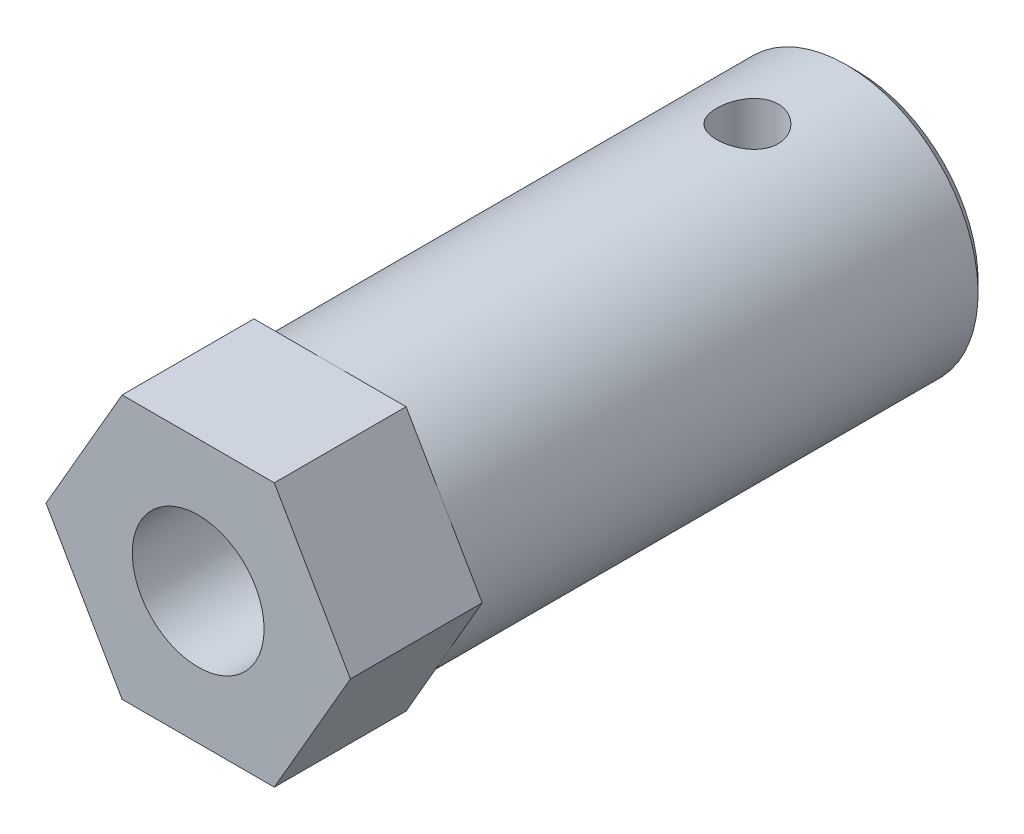
ISO-10303-21;
HEADER;
FILE_DESCRIPTION(('STEP AP214'),'2;1');
FILE_NAME('part.step','',(''),(''),'','','');
FILE_SCHEMA(('AUTOMOTIVE_DESIGN { 1 0 10303 214 1 1 1 1 }'));
ENDSEC;
DATA;
#1=APPLICATION_CONTEXT('core data for automotive mechanical design processes');
#2=APPLICATION_PROTOCOL_DEFINITION('international standard','automotive_design',2000,#1);
#3=PRODUCT_CONTEXT('',#1,'mechanical');
#4=PRODUCT('Part','Part','',(#3));
#5=PRODUCT_RELATED_PRODUCT_CATEGORY('part','',(#4));
#6=PRODUCT_DEFINITION_FORMATION('','',#4);
#7=PRODUCT_DEFINITION_CONTEXT('part definition',#1,'design');
#8=PRODUCT_DEFINITION('design','',#6,#7);
#9=PRODUCT_DEFINITION_SHAPE('','',#8);
#10=(LENGTH_UNIT() NAMED_UNIT(*) SI_UNIT(.MILLI.,.METRE.));
#11=(NAMED_UNIT(*) PLANE_ANGLE_UNIT() SI_UNIT($,.RADIAN.));
#12=(NAMED_UNIT(*) SI_UNIT($,.STERADIAN.) SOLID_ANGLE_UNIT());
#13=UNCERTAINTY_MEASURE_WITH_UNIT(LENGTH_MEASURE(1.E-05),#10,'distance_accuracy_value','');
#14=(GEOMETRIC_REPRESENTATION_CONTEXT(3) GLOBAL_UNCERTAINTY_ASSIGNED_CONTEXT((#13)) GLOBAL_UNIT_ASSIGNED_CONTEXT((#10,
#11,#12)) REPRESENTATION_CONTEXT('',''));
#15=CARTESIAN_POINT('',(0.,0.,0.));
#16=DIRECTION('',(0.,0.,1.));
#17=DIRECTION('',(1.,0.,0.));
#18=AXIS2_PLACEMENT_3D('',#15,#16,#17);
#19=CARTESIAN_POINT('',(0.,0.,0.));
#20=DIRECTION('',(0.,0.,-1.));
#21=DIRECTION('',(0.,1.,0.));
#22=AXIS2_PLACEMENT_3D('',#19,#20,#21);
#23=PLANE('',#22);
#24=CARTESIAN_POINT('',(0.,0.,0.));
#25=DIRECTION('',(0.,0.,-1.));
#26=DIRECTION('',(0.,1.,0.));
#27=AXIS2_PLACEMENT_3D('',#24,#25,#26);
#28=CIRCLE('',#27,5.49999999999999);
#29=CARTESIAN_POINT('',(0.,5.49999999999999,0.));
#30=VERTEX_POINT('',#29);
#31=EDGE_CURVE('E55',#30,#30,#28,.T.);
#32=ORIENTED_EDGE('',*,*,#31,.T.);
#33=EDGE_LOOP('',(#32));
#34=FACE_BOUND('',#33,.T.);
#35=CARTESIAN_POINT('',(0.,0.,0.));
#36=DIRECTION('',(0.,0.,-1.));
#37=DIRECTION('',(0.,1.,0.));
#38=AXIS2_PLACEMENT_3D('',#35,#36,#37);
#39=CIRCLE('',#38,3.);
#40=CARTESIAN_POINT('',(0.,3.,0.));
#41=VERTEX_POINT('',#40);
#42=EDGE_CURVE('E205',#41,#41,#39,.T.);
#43=ORIENTED_EDGE('',*,*,#42,.F.);
#44=EDGE_LOOP('',(#43));
#45=FACE_BOUND('',#44,.T.);
#46=ADVANCED_FACE('F47',(#34,#45),#23,.T.);
#47=CARTESIAN_POINT('',(0.,0.,0.));
#48=DIRECTION('',(0.,0.,-1.));
#49=DIRECTION('',(0.,1.,0.));
#50=AXIS2_PLACEMENT_3D('',#47,#48,#49);
#51=CYLINDRICAL_SURFACE('',#50,6.);
#52=CARTESIAN_POINT('',(0.,0.,0.500000000000006));
#53=DIRECTION('',(0.,0.,-1.));
#54=DIRECTION('',(0.,1.,0.));
#55=AXIS2_PLACEMENT_3D('',#52,#53,#54);
#56=CIRCLE('',#55,6.);
#57=CARTESIAN_POINT('',(0.,6.,0.500000000000007));
#58=VERTEX_POINT('',#57);
#59=EDGE_CURVE('E13',#58,#58,#56,.F.);
#60=ORIENTED_EDGE('',*,*,#59,.T.);
#61=EDGE_LOOP('',(#60));
#62=FACE_BOUND('',#61,.T.);
#63=CARTESIAN_POINT('',(0.,-6.,6.40094846558941));
#64=CARTESIAN_POINT('',(-0.0775646736010136,-5.99999860426637,6.4009460168212));
#65=CARTESIAN_POINT('',(-0.155157869101644,-5.99848078082007,6.39448509813016));
#66=CARTESIAN_POINT('',(-0.308131171257111,-5.99257268754221,6.36884435862417));
#67=CARTESIAN_POINT('',(-0.383509813147784,-5.98818055935896,6.34965630910703));
#68=CARTESIAN_POINT('',(-0.529821918733617,-5.97701167260987,6.29920223164303));
#69=CARTESIAN_POINT('',(-0.600760243790256,-5.97023757763977,6.26794969081428));
#70=CARTESIAN_POINT('',(-0.736385611116713,-5.95503143244892,6.1942987482493));
#71=CARTESIAN_POINT('',(-0.801072642028233,-5.94659937921582,6.15190032626205));
#72=CARTESIAN_POINT('',(-0.923533668961658,-5.92882626510498,6.05634808470236));
#73=CARTESIAN_POINT('',(-0.981178086156553,-5.91947264813553,6.00303051874646));
#74=CARTESIAN_POINT('',(-1.08679276786767,-5.90099673976627,5.88750458011275));
#75=CARTESIAN_POINT('',(-1.13476206995287,-5.89187447145868,5.8252953239857));
#76=CARTESIAN_POINT('',(-1.22025370697959,-5.87476910962088,5.6927718895738));
#77=CARTESIAN_POINT('',(-1.25763490143858,-5.86680204039297,5.62236440620348));
#78=CARTESIAN_POINT('',(-1.31998283038882,-5.8530907422514,5.47604956044999));
#79=CARTESIAN_POINT('',(-1.3449512743084,-5.84734620728446,5.4001429570315));
#80=CARTESIAN_POINT('',(-1.38133036387758,-5.83885884038775,5.24639924534206));
#81=CARTESIAN_POINT('',(-1.39297209503853,-5.83606491320274,5.16861970031));
#82=CARTESIAN_POINT('',(-1.40308642252089,-5.83364188660955,5.01216519902715));
#83=CARTESIAN_POINT('',(-1.40156087352066,-5.834012341482,4.93349037044062));
#84=CARTESIAN_POINT('',(-1.38556917975452,-5.83783011197488,4.77922041266738));
#85=CARTESIAN_POINT('',(-1.37137458844112,-5.84121285746307,4.70359529068618));
#86=CARTESIAN_POINT('',(-1.33087931641785,-5.85057160192954,4.5558304410802));
#87=CARTESIAN_POINT('',(-1.30457787223809,-5.85654776444987,4.48369093357872));
#88=CARTESIAN_POINT('',(-1.24037441904748,-5.87048160445412,4.34419783846292));
#89=CARTESIAN_POINT('',(-1.20237068755617,-5.87845653850497,4.27689286569985));
#90=CARTESIAN_POINT('',(-1.11591278567823,-5.89547915600352,4.14951628809328));
#91=CARTESIAN_POINT('',(-1.06745700437427,-5.90452700471681,4.08944580048792));
#92=CARTESIAN_POINT('',(-0.960047071164424,-5.92295069208077,3.97668315713093));
#93=CARTESIAN_POINT('',(-0.900862785032838,-5.93232910637964,3.9242103886945));
#94=CARTESIAN_POINT('',(-0.774425201503653,-5.95015422679595,3.8298963424438));
#95=CARTESIAN_POINT('',(-0.707171715642057,-5.95860091114308,3.78805531301531));
#96=CARTESIAN_POINT('',(-0.566216448015675,-5.97364458524895,3.71612637726424));
#97=CARTESIAN_POINT('',(-0.492497826030469,-5.98023654413718,3.68607035213437));
#98=CARTESIAN_POINT('',(-0.34086736535091,-5.99079108348902,3.63883546792299));
#99=CARTESIAN_POINT('',(-0.262956226015757,-5.99475410102881,3.62165446823499));
#100=CARTESIAN_POINT('',(-0.10703135425192,-5.99954088964069,3.60098369480449));
#101=CARTESIAN_POINT('',(-0.0290593433879069,-6.0004332634398,3.59719467124656));
#102=CARTESIAN_POINT('',(0.12640386959129,-5.999171898539,3.60259989766327));
#103=CARTESIAN_POINT('',(0.203895108667768,-5.99701839699234,3.61179313683293));
#104=CARTESIAN_POINT('',(0.355183481446818,-5.98995085862466,3.64265437332171));
#105=CARTESIAN_POINT('',(0.42901502157663,-5.98507221138883,3.66416253314812));
#106=CARTESIAN_POINT('',(0.572020787240305,-5.9731018679303,3.71886331285285));
#107=CARTESIAN_POINT('',(0.6411945793041,-5.96600996607775,3.75205701845284));
#108=CARTESIAN_POINT('',(0.774137433063865,-5.9502325862055,3.82979013410757));
#109=CARTESIAN_POINT('',(0.837803023999157,-5.94152355464407,3.8745016137328));
#110=CARTESIAN_POINT('',(0.956834557002853,-5.92352073334699,3.97377759436269));
#111=CARTESIAN_POINT('',(1.01219925753968,-5.91422685643286,4.02834356657991));
#112=CARTESIAN_POINT('',(1.11426372737325,-5.89586021377287,4.14716082320374));
#113=CARTESIAN_POINT('',(1.16075495471842,-5.8867963105178,4.21159288685953));
#114=CARTESIAN_POINT('',(1.24226042498125,-5.8701385403962,4.34752422477829));
#115=CARTESIAN_POINT('',(1.27727517998939,-5.86254460794445,4.41902318352472));
#116=CARTESIAN_POINT('',(1.33458333497005,-5.8497649447769,4.56666830993333));
#117=CARTESIAN_POINT('',(1.35695106969073,-5.84456517627704,4.64278434804597));
#118=CARTESIAN_POINT('',(1.38853948991626,-5.83714195964828,4.7978338494126));
#119=CARTESIAN_POINT('',(1.39776262186979,-5.83491795768003,4.87676678558687));
#120=CARTESIAN_POINT('',(1.40268483506216,-5.8337363825808,5.03309834703035));
#121=CARTESIAN_POINT('',(1.39871569736413,-5.83469867296605,5.11048609947146));
#122=CARTESIAN_POINT('',(1.37811580313144,-5.83959817252098,5.26345671810422));
#123=CARTESIAN_POINT('',(1.36148524115384,-5.84353533597839,5.33903961201115));
#124=CARTESIAN_POINT('',(1.31620471463434,-5.85389927852566,5.4859470674106));
#125=CARTESIAN_POINT('',(1.28760942298848,-5.86031472298885,5.55728933397125));
#126=CARTESIAN_POINT('',(1.2192559505642,-5.87491539847532,5.69421073085698));
#127=CARTESIAN_POINT('',(1.17949642501367,-5.88310084267409,5.75978916565756));
#128=CARTESIAN_POINT('',(1.08887030003946,-5.90055365089419,5.88494238400882));
#129=CARTESIAN_POINT('',(1.03777004968421,-5.90984150971164,5.94434514918208));
#130=CARTESIAN_POINT('',(0.926378378655749,-5.92832223930688,6.05384086938006));
#131=CARTESIAN_POINT('',(0.866084815097131,-5.93751508740363,6.10393164780075));
#132=CARTESIAN_POINT('',(0.736909387907452,-5.95493673753112,6.19411913965393));
#133=CARTESIAN_POINT('',(0.667910632457267,-5.96314871059119,6.23405189290732));
#134=CARTESIAN_POINT('',(0.523998581642466,-5.97751092184252,6.30168840360472));
#135=CARTESIAN_POINT('',(0.44908997673511,-5.98366277514448,6.32940174635269));
#136=CARTESIAN_POINT('',(0.311830159910776,-5.99219880153797,6.36724598637769));
#137=CARTESIAN_POINT('',(0.250183694376422,-5.99510524730076,6.37985888083515));
#138=CARTESIAN_POINT('',(0.125697684233831,-5.99900635753852,6.39671087377597));
#139=CARTESIAN_POINT('',(0.0628582079087964,-6.00000113109887,6.40095045006474));
#140=CARTESIAN_POINT('',(0.,-6.,6.40094846558941));
#141=B_SPLINE_CURVE_WITH_KNOTS('',3,(#63,#64,#65,#66,#67,#68,#69,#70,#71,#72,#73,#74,#75,#76,
#77,#78,#79,#80,#81,#82,#83,#84,#85,#86,#87,#88,#89,#90,#91,#92,#93,#94,#95,#96,#97,#98,#99,
#100,#101,#102,#103,#104,#105,#106,#107,#108,#109,#110,#111,#112,#113,#114,#115,#116,#117,#118,
#119,#120,#121,#122,#123,#124,#125,#126,#127,#128,#129,#130,#131,#132,#133,#134,#135,#136,#137,
#138,#139,#140),.UNSPECIFIED.,.T.,.F.,(4,2,2,2,2,2,2,2,2,2,2,2,2,2,2,2,2,2,2,2,2,2,2,2,2,2,2,2,
2,2,2,2,2,2,2,2,2,2,4),(0.,0.23246381582018,0.46507807737571,0.697433044709316,0.92978843421272,
1.16592373722062,1.40208251818958,1.64125523021522,1.88039499531683,2.11532208127955,
2.35021607710783,2.58019304630917,2.81018452006863,3.04223450506692,3.27432028024895,
3.51214965538996,3.74998458634869,3.98845854918853,4.22689285445725,4.45996432378352,
4.69301764705797,4.92311256327936,5.15322886361121,5.38700545712134,5.62081698087324,
5.85958450844443,6.09834138054358,6.33567993309828,6.57297430687765,6.80434641645197,
7.035714970805,7.2660376361078,7.49638805651377,7.73201720366344,7.96770135822205,
8.20697768020771,8.44606597066264,8.63446478775921,8.82285285397169),.UNSPECIFIED.);
#142=CARTESIAN_POINT('',(0.,-6.,6.40094846558941));
#143=VERTEX_POINT('',#142);
#144=EDGE_CURVE('E184',#143,#143,#141,.T.);
#145=ORIENTED_EDGE('',*,*,#144,.F.);
#146=EDGE_LOOP('',(#145));
#147=FACE_BOUND('',#146,.T.);
#148=CARTESIAN_POINT('',(0.,6.,6.40094846558941));
#149=CARTESIAN_POINT('',(0.0775646736010136,5.99999860426637,6.4009460168212));
#150=CARTESIAN_POINT('',(0.155157869101644,5.99848078082007,6.39448509813016));
#151=CARTESIAN_POINT('',(0.308131171257111,5.99257268754221,6.36884435862417));
#152=CARTESIAN_POINT('',(0.383509813147784,5.98818055935896,6.34965630910703));
#153=CARTESIAN_POINT('',(0.529821918733616,5.97701167260987,6.29920223164303));
#154=CARTESIAN_POINT('',(0.600760243790255,5.97023757763977,6.26794969081428));
#155=CARTESIAN_POINT('',(0.736385611116713,5.95503143244892,6.1942987482493));
#156=CARTESIAN_POINT('',(0.801072642028232,5.94659937921582,6.15190032626205));
#157=CARTESIAN_POINT('',(0.923533668961658,5.92882626510498,6.05634808470236));
#158=CARTESIAN_POINT('',(0.981178086156552,5.91947264813553,6.00303051874646));
#159=CARTESIAN_POINT('',(1.08679276786767,5.90099673976627,5.88750458011275));
#160=CARTESIAN_POINT('',(1.13476206995287,5.89187447145868,5.8252953239857));
#161=CARTESIAN_POINT('',(1.22025370697959,5.87476910962087,5.6927718895738));
#162=CARTESIAN_POINT('',(1.25763490143858,5.86680204039297,5.62236440620348));
#163=CARTESIAN_POINT('',(1.31998283038882,5.8530907422514,5.47604956044999));
#164=CARTESIAN_POINT('',(1.3449512743084,5.84734620728446,5.4001429570315));
#165=CARTESIAN_POINT('',(1.38133036387757,5.83885884038775,5.24639924534206));
#166=CARTESIAN_POINT('',(1.39297209503853,5.83606491320274,5.16861970031));
#167=CARTESIAN_POINT('',(1.40308642252089,5.83364188660955,5.01216519902715));
#168=CARTESIAN_POINT('',(1.40156087352066,5.834012341482,4.93349037044062));
#169=CARTESIAN_POINT('',(1.38556917975452,5.83783011197488,4.77922041266738));
#170=CARTESIAN_POINT('',(1.37137458844112,5.84121285746307,4.70359529068618));
#171=CARTESIAN_POINT('',(1.33087931641785,5.85057160192954,4.5558304410802));
#172=CARTESIAN_POINT('',(1.30457787223809,5.85654776444987,4.48369093357872));
#173=CARTESIAN_POINT('',(1.24037441904748,5.87048160445412,4.34419783846292));
#174=CARTESIAN_POINT('',(1.20237068755617,5.87845653850496,4.27689286569985));
#175=CARTESIAN_POINT('',(1.11591278567823,5.89547915600352,4.14951628809328));
#176=CARTESIAN_POINT('',(1.06745700437427,5.90452700471681,4.08944580048792));
#177=CARTESIAN_POINT('',(0.960047071164424,5.92295069208077,3.97668315713093));
#178=CARTESIAN_POINT('',(0.900862785032839,5.93232910637964,3.9242103886945));
#179=CARTESIAN_POINT('',(0.774425201503653,5.95015422679595,3.8298963424438));
#180=CARTESIAN_POINT('',(0.707171715642057,5.95860091114308,3.78805531301531));
#181=CARTESIAN_POINT('',(0.566216448015675,5.97364458524895,3.71612637726424));
#182=CARTESIAN_POINT('',(0.49249782603047,5.98023654413718,3.68607035213437));
#183=CARTESIAN_POINT('',(0.34086736535091,5.99079108348902,3.63883546792299));
#184=CARTESIAN_POINT('',(0.262956226015758,5.99475410102881,3.62165446823499));
#185=CARTESIAN_POINT('',(0.10703135425192,5.99954088964068,3.60098369480449));
#186=CARTESIAN_POINT('',(0.0290593433879075,6.00043326343979,3.59719467124656));
#187=CARTESIAN_POINT('',(-0.12640386959129,5.999171898539,3.60259989766327));
#188=CARTESIAN_POINT('',(-0.203895108667768,5.99701839699234,3.61179313683293));
#189=CARTESIAN_POINT('',(-0.355183481446817,5.98995085862466,3.64265437332171));
#190=CARTESIAN_POINT('',(-0.429015021576629,5.98507221138882,3.66416253314812));
#191=CARTESIAN_POINT('',(-0.572020787240305,5.9731018679303,3.71886331285285));
#192=CARTESIAN_POINT('',(-0.6411945793041,5.96600996607775,3.75205701845284));
#193=CARTESIAN_POINT('',(-0.774137433063864,5.9502325862055,3.82979013410757));
#194=CARTESIAN_POINT('',(-0.837803023999156,5.94152355464406,3.8745016137328));
#195=CARTESIAN_POINT('',(-0.956834557002853,5.92352073334699,3.97377759436269));
#196=CARTESIAN_POINT('',(-1.01219925753968,5.91422685643286,4.02834356657991));
#197=CARTESIAN_POINT('',(-1.11426372737325,5.89586021377287,4.14716082320374));
#198=CARTESIAN_POINT('',(-1.16075495471842,5.8867963105178,4.21159288685953));
#199=CARTESIAN_POINT('',(-1.24226042498125,5.8701385403962,4.34752422477829));
#200=CARTESIAN_POINT('',(-1.27727517998939,5.86254460794445,4.41902318352472));
#201=CARTESIAN_POINT('',(-1.33458333497005,5.84976494477689,4.56666830993333));
#202=CARTESIAN_POINT('',(-1.35695106969073,5.84456517627704,4.64278434804597));
#203=CARTESIAN_POINT('',(-1.38853948991626,5.83714195964828,4.7978338494126));
#204=CARTESIAN_POINT('',(-1.39776262186979,5.83491795768003,4.87676678558687));
#205=CARTESIAN_POINT('',(-1.40268483506216,5.8337363825808,5.03309834703035));
#206=CARTESIAN_POINT('',(-1.39871569736413,5.83469867296605,5.11048609947146));
#207=CARTESIAN_POINT('',(-1.37811580313144,5.83959817252098,5.26345671810422));
#208=CARTESIAN_POINT('',(-1.36148524115384,5.84353533597839,5.33903961201115));
#209=CARTESIAN_POINT('',(-1.31620471463434,5.85389927852565,5.4859470674106));
#210=CARTESIAN_POINT('',(-1.28760942298848,5.86031472298885,5.55728933397125));
#211=CARTESIAN_POINT('',(-1.2192559505642,5.87491539847531,5.69421073085697));
#212=CARTESIAN_POINT('',(-1.17949642501367,5.88310084267409,5.75978916565756));
#213=CARTESIAN_POINT('',(-1.08887030003946,5.90055365089419,5.88494238400882));
#214=CARTESIAN_POINT('',(-1.03777004968421,5.90984150971163,5.94434514918208));
#215=CARTESIAN_POINT('',(-0.92637837865575,5.92832223930688,6.05384086938006));
#216=CARTESIAN_POINT('',(-0.866084815097131,5.93751508740363,6.10393164780075));
#217=CARTESIAN_POINT('',(-0.736909387907453,5.95493673753112,6.19411913965393));
#218=CARTESIAN_POINT('',(-0.667910632457268,5.96314871059119,6.23405189290732));
#219=CARTESIAN_POINT('',(-0.523998581642468,5.97751092184251,6.30168840360472));
#220=CARTESIAN_POINT('',(-0.449089976735111,5.98366277514448,6.32940174635269));
#221=CARTESIAN_POINT('',(-0.311830159910777,5.99219880153797,6.36724598637769));
#222=CARTESIAN_POINT('',(-0.250183694376423,5.99510524730075,6.37985888083515));
#223=CARTESIAN_POINT('',(-0.125697684233832,5.99900635753852,6.39671087377597));
#224=CARTESIAN_POINT('',(-0.0628582079087965,6.00000113109888,6.40095045006474));
#225=CARTESIAN_POINT('',(0.,6.,6.40094846558941));
#226=B_SPLINE_CURVE_WITH_KNOTS('',3,(#148,#149,#150,#151,#152,#153,#154,#155,#156,#157,#158,
#159,#160,#161,#162,#163,#164,#165,#166,#167,#168,#169,#170,#171,#172,#173,#174,#175,#176,#177,
#178,#179,#180,#181,#182,#183,#184,#185,#186,#187,#188,#189,#190,#191,#192,#193,#194,#195,#196,
#197,#198,#199,#200,#201,#202,#203,#204,#205,#206,#207,#208,#209,#210,#211,#212,#213,#214,#215,
#216,#217,#218,#219,#220,#221,#222,#223,#224,#225),.UNSPECIFIED.,.T.,.F.,(4,2,2,2,2,2,2,2,2,2,2,
2,2,2,2,2,2,2,2,2,2,2,2,2,2,2,2,2,2,2,2,2,2,2,2,2,2,2,4),(0.,0.23246381582018,0.46507807737571,
0.697433044709315,0.92978843421272,1.16592373722062,1.40208251818958,1.64125523021522,
1.88039499531682,2.11532208127954,2.35021607710783,2.58019304630916,2.81018452006863,
3.04223450506692,3.27432028024895,3.51214965538996,3.74998458634869,3.98845854918853,
4.22689285445725,4.45996432378352,4.69301764705797,4.92311256327936,5.15322886361121,
5.38700545712134,5.62081698087324,5.85958450844443,6.09834138054358,6.33567993309828,
6.57297430687765,6.80434641645197,7.035714970805,7.2660376361078,7.49638805651377,
7.73201720366344,7.96770135822205,8.20697768020771,8.44606597066264,8.63446478775922,
8.82285285397169),.UNSPECIFIED.);
#227=CARTESIAN_POINT('',(0.,6.,6.40094846558941));
#228=VERTEX_POINT('',#227);
#229=EDGE_CURVE('E179',#228,#228,#226,.T.);
#230=ORIENTED_EDGE('',*,*,#229,.F.);
#231=EDGE_LOOP('',(#230));
#232=FACE_BOUND('',#231,.T.);
#233=CARTESIAN_POINT('',(0.,0.,24.));
#234=DIRECTION('',(0.,0.,-1.));
#235=DIRECTION('',(0.,1.,0.));
#236=AXIS2_PLACEMENT_3D('',#233,#234,#235);
#237=CIRCLE('',#236,6.);
#238=CARTESIAN_POINT('',(0.,6.,24.));
#239=VERTEX_POINT('',#238);
#240=CARTESIAN_POINT('',(5.19615242270663,3.,24.));
#241=VERTEX_POINT('',#240);
#242=EDGE_CURVE('E150',#239,#241,#237,.T.);
#243=ORIENTED_EDGE('',*,*,#242,.T.);
#244=CARTESIAN_POINT('',(5.19615242270663,-3.,24.));
#245=VERTEX_POINT('',#244);
#246=EDGE_CURVE('E70',#241,#245,#237,.T.);
#247=ORIENTED_EDGE('',*,*,#246,.T.);
#248=CARTESIAN_POINT('',(0.,-6.,24.));
#249=VERTEX_POINT('',#248);
#250=EDGE_CURVE('E267',#245,#249,#237,.T.);
#251=ORIENTED_EDGE('',*,*,#250,.T.);
#252=CARTESIAN_POINT('',(-5.19615242270663,-3.00000000000001,24.));
#253=VERTEX_POINT('',#252);
#254=EDGE_CURVE('E268',#249,#253,#237,.T.);
#255=ORIENTED_EDGE('',*,*,#254,.T.);
#256=CARTESIAN_POINT('',(-5.19615242270663,2.99999999999999,24.));
#257=VERTEX_POINT('',#256);
#258=EDGE_CURVE('E148',#253,#257,#237,.T.);
#259=ORIENTED_EDGE('',*,*,#258,.T.);
#260=EDGE_CURVE('E145',#257,#239,#237,.T.);
#261=ORIENTED_EDGE('',*,*,#260,.T.);
#262=EDGE_LOOP('',(#243,#247,#251,#255,#259,#261));
#263=FACE_BOUND('',#262,.T.);
#264=ADVANCED_FACE('F188',(#62,#147,#232,#263),#51,.T.);
#265=CARTESIAN_POINT('',(0.,0.,24.));
#266=DIRECTION('',(0.,0.,1.));
#267=DIRECTION('',(1.,0.,0.));
#268=AXIS2_PLACEMENT_3D('',#265,#266,#267);
#269=PLANE('',#268);
#270=ORIENTED_EDGE('',*,*,#242,.F.);
#271=DIRECTION('',(-1.,0.,0.));
#272=VECTOR('',#271,1.);
#273=CARTESIAN_POINT('',(3.46410161513775,6.,24.));
#274=LINE('',#273,#272);
#275=CARTESIAN_POINT('',(3.46410161513775,6.,24.));
#276=VERTEX_POINT('',#275);
#277=EDGE_CURVE('E62',#276,#239,#274,.T.);
#278=ORIENTED_EDGE('',*,*,#277,.F.);
#279=DIRECTION('',(-0.5,0.866025403784439,0.));
#280=VECTOR('',#279,1.);
#281=CARTESIAN_POINT('',(6.92820323027551,0.,24.));
#282=LINE('',#281,#280);
#283=EDGE_CURVE('E220',#241,#276,#282,.T.);
#284=ORIENTED_EDGE('',*,*,#283,.F.);
#285=EDGE_LOOP('',(#270,#278,#284));
#286=FACE_BOUND('',#285,.T.);
#287=ADVANCED_FACE('F192',(#286),#269,.F.);
#288=ORIENTED_EDGE('',*,*,#246,.F.);
#289=CARTESIAN_POINT('',(6.92820323027551,0.,24.));
#290=VERTEX_POINT('',#289);
#291=EDGE_CURVE('E221',#290,#241,#282,.T.);
#292=ORIENTED_EDGE('',*,*,#291,.F.);
#293=DIRECTION('',(0.499999999999999,0.866025403784439,0.));
#294=VECTOR('',#293,1.);
#295=CARTESIAN_POINT('',(3.46410161513776,-6.,24.));
#296=LINE('',#295,#294);
#297=EDGE_CURVE('E144',#245,#290,#296,.T.);
#298=ORIENTED_EDGE('',*,*,#297,.F.);
#299=EDGE_LOOP('',(#288,#292,#298));
#300=FACE_BOUND('',#299,.T.);
#301=ADVANCED_FACE('F307',(#300),#269,.F.);
#302=ORIENTED_EDGE('',*,*,#250,.F.);
#303=CARTESIAN_POINT('',(3.46410161513776,-6.,24.));
#304=VERTEX_POINT('',#303);
#305=EDGE_CURVE('E208',#304,#245,#296,.T.);
#306=ORIENTED_EDGE('',*,*,#305,.F.);
#307=DIRECTION('',(1.,0.,0.));
#308=VECTOR('',#307,1.);
#309=CARTESIAN_POINT('',(-3.46410161513775,-6.,24.));
#310=LINE('',#309,#308);
#311=EDGE_CURVE('E233',#249,#304,#310,.T.);
#312=ORIENTED_EDGE('',*,*,#311,.F.);
#313=EDGE_LOOP('',(#302,#306,#312));
#314=FACE_BOUND('',#313,.T.);
#315=ADVANCED_FACE('F275',(#314),#269,.F.);
#316=ORIENTED_EDGE('',*,*,#254,.F.);
#317=CARTESIAN_POINT('',(-3.46410161513775,-6.,24.));
#318=VERTEX_POINT('',#317);
#319=EDGE_CURVE('E140',#318,#249,#310,.T.);
#320=ORIENTED_EDGE('',*,*,#319,.F.);
#321=DIRECTION('',(0.5,-0.866025403784438,0.));
#322=VECTOR('',#321,1.);
#323=CARTESIAN_POINT('',(-6.92820323027551,0.,24.));
#324=LINE('',#323,#322);
#325=EDGE_CURVE('E229',#253,#318,#324,.T.);
#326=ORIENTED_EDGE('',*,*,#325,.F.);
#327=EDGE_LOOP('',(#316,#320,#326));
#328=FACE_BOUND('',#327,.T.);
#329=ADVANCED_FACE('F272',(#328),#269,.F.);
#330=ORIENTED_EDGE('',*,*,#258,.F.);
#331=CARTESIAN_POINT('',(-6.92820323027551,0.,24.));
#332=VERTEX_POINT('',#331);
#333=EDGE_CURVE('E230',#332,#253,#324,.T.);
#334=ORIENTED_EDGE('',*,*,#333,.F.);
#335=DIRECTION('',(-0.5,-0.866025403784439,0.));
#336=VECTOR('',#335,1.);
#337=CARTESIAN_POINT('',(-3.46410161513775,6.,24.));
#338=LINE('',#337,#336);
#339=EDGE_CURVE('E225',#257,#332,#338,.T.);
#340=ORIENTED_EDGE('',*,*,#339,.F.);
#341=EDGE_LOOP('',(#330,#334,#340));
#342=FACE_BOUND('',#341,.T.);
#343=ADVANCED_FACE('F257',(#342),#269,.F.);
#344=CARTESIAN_POINT('',(3.46410161513776,-6.,30.));
#345=DIRECTION('',(-0.866025403784439,0.499999999999999,0.));
#346=DIRECTION('',(-0.499999999999999,-0.866025403784439,0.));
#347=AXIS2_PLACEMENT_3D('',#344,#345,#346);
#348=PLANE('',#347);
#349=ORIENTED_EDGE('',*,*,#305,.T.);
#350=ORIENTED_EDGE('',*,*,#297,.T.);
#351=DIRECTION('',(0.,0.,-1.));
#352=VECTOR('',#351,1.);
#353=CARTESIAN_POINT('',(6.92820323027551,0.,30.));
#354=LINE('',#353,#352);
#355=CARTESIAN_POINT('',(6.92820323027551,0.,30.));
#356=VERTEX_POINT('',#355);
#357=EDGE_CURVE('E126',#356,#290,#354,.T.);
#358=ORIENTED_EDGE('',*,*,#357,.F.);
#359=DIRECTION('',(0.499999999999999,0.866025403784439,0.));
#360=VECTOR('',#359,1.);
#361=CARTESIAN_POINT('',(3.46410161513776,-6.,30.));
#362=LINE('',#361,#360);
#363=CARTESIAN_POINT('',(3.46410161513776,-6.,30.));
#364=VERTEX_POINT('',#363);
#365=EDGE_CURVE('E131',#364,#356,#362,.T.);
#366=ORIENTED_EDGE('',*,*,#365,.F.);
#367=DIRECTION('',(0.,0.,-1.));
#368=VECTOR('',#367,1.);
#369=CARTESIAN_POINT('',(3.46410161513776,-6.,30.));
#370=LINE('',#369,#368);
#371=EDGE_CURVE('E218',#364,#304,#370,.T.);
#372=ORIENTED_EDGE('',*,*,#371,.T.);
#373=EDGE_LOOP('',(#349,#350,#358,#366,#372));
#374=FACE_BOUND('',#373,.T.);
#375=ADVANCED_FACE('F143',(#374),#348,.F.);
#376=CARTESIAN_POINT('',(6.92820323027551,0.,30.));
#377=DIRECTION('',(-0.866025403784439,-0.5,0.));
#378=DIRECTION('',(0.5,-0.866025403784439,0.));
#379=AXIS2_PLACEMENT_3D('',#376,#377,#378);
#380=PLANE('',#379);
#381=ORIENTED_EDGE('',*,*,#291,.T.);
#382=ORIENTED_EDGE('',*,*,#283,.T.);
#383=DIRECTION('',(0.,0.,-1.));
#384=VECTOR('',#383,1.);
#385=CARTESIAN_POINT('',(3.46410161513775,6.,30.));
#386=LINE('',#385,#384);
#387=CARTESIAN_POINT('',(3.46410161513775,6.,30.));
#388=VERTEX_POINT('',#387);
#389=EDGE_CURVE('E127',#388,#276,#386,.T.);
#390=ORIENTED_EDGE('',*,*,#389,.F.);
#391=DIRECTION('',(-0.5,0.866025403784439,0.));
#392=VECTOR('',#391,1.);
#393=CARTESIAN_POINT('',(6.92820323027551,0.,30.));
#394=LINE('',#393,#392);
#395=EDGE_CURVE('E121',#356,#388,#394,.T.);
#396=ORIENTED_EDGE('',*,*,#395,.F.);
#397=ORIENTED_EDGE('',*,*,#357,.T.);
#398=EDGE_LOOP('',(#381,#382,#390,#396,#397));
#399=FACE_BOUND('',#398,.T.);
#400=ADVANCED_FACE('F124',(#399),#380,.F.);
#401=CARTESIAN_POINT('',(3.46410161513775,6.,30.));
#402=DIRECTION('',(0.,-1.,0.));
#403=DIRECTION('',(1.,0.,0.));
#404=AXIS2_PLACEMENT_3D('',#401,#402,#403);
#405=PLANE('',#404);
#406=ORIENTED_EDGE('',*,*,#277,.T.);
#407=CARTESIAN_POINT('',(-3.46410161513775,6.,24.));
#408=VERTEX_POINT('',#407);
#409=EDGE_CURVE('E223',#239,#408,#274,.T.);
#410=ORIENTED_EDGE('',*,*,#409,.T.);
#411=DIRECTION('',(0.,0.,-1.));
#412=VECTOR('',#411,1.);
#413=CARTESIAN_POINT('',(-3.46410161513775,6.,30.));
#414=LINE('',#413,#412);
#415=CARTESIAN_POINT('',(-3.46410161513775,6.,30.));
#416=VERTEX_POINT('',#415);
#417=EDGE_CURVE('E151',#416,#408,#414,.T.);
#418=ORIENTED_EDGE('',*,*,#417,.F.);
#419=DIRECTION('',(-1.,0.,0.));
#420=VECTOR('',#419,1.);
#421=CARTESIAN_POINT('',(3.46410161513775,6.,30.));
#422=LINE('',#421,#420);
#423=EDGE_CURVE('E130',#388,#416,#422,.T.);
#424=ORIENTED_EDGE('',*,*,#423,.F.);
#425=ORIENTED_EDGE('',*,*,#389,.T.);
#426=EDGE_LOOP('',(#406,#410,#418,#424,#425));
#427=FACE_BOUND('',#426,.T.);
#428=ADVANCED_FACE('F264',(#427),#405,.F.);
#429=CARTESIAN_POINT('',(-3.46410161513775,6.,30.));
#430=DIRECTION('',(0.866025403784439,-0.5,0.));
#431=DIRECTION('',(0.5,0.866025403784439,0.));
#432=AXIS2_PLACEMENT_3D('',#429,#430,#431);
#433=PLANE('',#432);
#434=EDGE_CURVE('E226',#408,#257,#338,.T.);
#435=ORIENTED_EDGE('',*,*,#434,.T.);
#436=ORIENTED_EDGE('',*,*,#339,.T.);
#437=DIRECTION('',(0.,0.,-1.));
#438=VECTOR('',#437,1.);
#439=CARTESIAN_POINT('',(-6.92820323027551,0.,30.));
#440=LINE('',#439,#438);
#441=CARTESIAN_POINT('',(-6.92820323027551,0.,30.));
#442=VERTEX_POINT('',#441);
#443=EDGE_CURVE('E240',#442,#332,#440,.T.);
#444=ORIENTED_EDGE('',*,*,#443,.F.);
#445=DIRECTION('',(-0.5,-0.866025403784439,0.));
#446=VECTOR('',#445,1.);
#447=CARTESIAN_POINT('',(-3.46410161513775,6.,30.));
#448=LINE('',#447,#446);
#449=EDGE_CURVE('E214',#416,#442,#448,.T.);
#450=ORIENTED_EDGE('',*,*,#449,.F.);
#451=ORIENTED_EDGE('',*,*,#417,.T.);
#452=EDGE_LOOP('',(#435,#436,#444,#450,#451));
#453=FACE_BOUND('',#452,.T.);
#454=ADVANCED_FACE('F247',(#453),#433,.F.);
#455=CARTESIAN_POINT('',(-6.92820323027551,0.,30.));
#456=DIRECTION('',(0.866025403784438,0.5,0.));
#457=DIRECTION('',(-0.5,0.866025403784438,0.));
#458=AXIS2_PLACEMENT_3D('',#455,#456,#457);
#459=PLANE('',#458);
#460=ORIENTED_EDGE('',*,*,#333,.T.);
#461=ORIENTED_EDGE('',*,*,#325,.T.);
#462=DIRECTION('',(0.,0.,-1.));
#463=VECTOR('',#462,1.);
#464=CARTESIAN_POINT('',(-3.46410161513775,-6.,30.));
#465=LINE('',#464,#463);
#466=CARTESIAN_POINT('',(-3.46410161513775,-6.,30.));
#467=VERTEX_POINT('',#466);
#468=EDGE_CURVE('E237',#467,#318,#465,.T.);
#469=ORIENTED_EDGE('',*,*,#468,.F.);
#470=DIRECTION('',(0.5,-0.866025403784438,0.));
#471=VECTOR('',#470,1.);
#472=CARTESIAN_POINT('',(-6.92820323027551,0.,30.));
#473=LINE('',#472,#471);
#474=EDGE_CURVE('E216',#442,#467,#473,.T.);
#475=ORIENTED_EDGE('',*,*,#474,.F.);
#476=ORIENTED_EDGE('',*,*,#443,.T.);
#477=EDGE_LOOP('',(#460,#461,#469,#475,#476));
#478=FACE_BOUND('',#477,.T.);
#479=ADVANCED_FACE('F261',(#478),#459,.F.);
#480=CARTESIAN_POINT('',(-3.46410161513775,-6.,30.));
#481=DIRECTION('',(0.,1.,0.));
#482=DIRECTION('',(0.,0.,1.));
#483=AXIS2_PLACEMENT_3D('',#480,#481,#482);
#484=PLANE('',#483);
#485=ORIENTED_EDGE('',*,*,#319,.T.);
#486=ORIENTED_EDGE('',*,*,#311,.T.);
#487=ORIENTED_EDGE('',*,*,#371,.F.);
#488=DIRECTION('',(1.,0.,0.));
#489=VECTOR('',#488,1.);
#490=CARTESIAN_POINT('',(-3.46410161513775,-6.,30.));
#491=LINE('',#490,#489);
#492=EDGE_CURVE('E136',#467,#364,#491,.T.);
#493=ORIENTED_EDGE('',*,*,#492,.F.);
#494=ORIENTED_EDGE('',*,*,#468,.T.);
#495=EDGE_LOOP('',(#485,#486,#487,#493,#494));
#496=FACE_BOUND('',#495,.T.);
#497=ADVANCED_FACE('F277',(#496),#484,.F.);
#498=CARTESIAN_POINT('',(0.,0.,30.));
#499=DIRECTION('',(0.,0.,1.));
#500=DIRECTION('',(1.,0.,0.));
#501=AXIS2_PLACEMENT_3D('',#498,#499,#500);
#502=PLANE('',#501);
#503=CARTESIAN_POINT('',(0.,0.,30.));
#504=DIRECTION('',(0.,0.,1.));
#505=DIRECTION('',(1.,0.,0.));
#506=AXIS2_PLACEMENT_3D('',#503,#504,#505);
#507=CIRCLE('',#506,3.);
#508=CARTESIAN_POINT('',(3.,0.,30.));
#509=VERTEX_POINT('',#508);
#510=EDGE_CURVE('E207',#509,#509,#507,.F.);
#511=ORIENTED_EDGE('',*,*,#510,.T.);
#512=EDGE_LOOP('',(#511));
#513=FACE_BOUND('',#512,.T.);
#514=ORIENTED_EDGE('',*,*,#365,.T.);
#515=ORIENTED_EDGE('',*,*,#395,.T.);
#516=ORIENTED_EDGE('',*,*,#423,.T.);
#517=ORIENTED_EDGE('',*,*,#449,.T.);
#518=ORIENTED_EDGE('',*,*,#474,.T.);
#519=ORIENTED_EDGE('',*,*,#492,.T.);
#520=EDGE_LOOP('',(#514,#515,#516,#517,#518,#519));
#521=FACE_BOUND('',#520,.T.);
#522=ADVANCED_FACE('F134',(#513,#521),#502,.T.);
#523=ORIENTED_EDGE('',*,*,#260,.F.);
#524=ORIENTED_EDGE('',*,*,#434,.F.);
#525=ORIENTED_EDGE('',*,*,#409,.F.);
#526=EDGE_LOOP('',(#523,#524,#525));
#527=FACE_BOUND('',#526,.T.);
#528=ADVANCED_FACE('F251',(#527),#269,.F.);
#529=CARTESIAN_POINT('',(0.,0.,30.001));
#530=DIRECTION('',(0.,0.,-1.));
#531=DIRECTION('',(0.,1.,0.));
#532=AXIS2_PLACEMENT_3D('',#529,#530,#531);
#533=CYLINDRICAL_SURFACE('',#532,3.);
#534=CARTESIAN_POINT('',(0.,3.,6.40094846558941));
#535=CARTESIAN_POINT('',(0.0742209343345289,2.99999658912274,6.40094440519128));
#536=CARTESIAN_POINT('',(0.148547188118565,2.99721530128015,6.39501548008995));
#537=CARTESIAN_POINT('',(0.295038735633478,2.98636486712024,6.37154520505363));
#538=CARTESIAN_POINT('',(0.36719887842698,2.97828402237263,6.3539781638516));
#539=CARTESIAN_POINT('',(0.507009588469891,2.95768764371345,6.30804851736166));
#540=CARTESIAN_POINT('',(0.574675782485616,2.94518854877645,6.27972590167747));
#541=CARTESIAN_POINT('',(0.704212520501893,2.9169309234461,6.21327853468242));
#542=CARTESIAN_POINT('',(0.766084028891887,2.90117293682428,6.17515541840398));
#543=CARTESIAN_POINT('',(0.886090909736676,2.8668708479262,6.08779841460079));
#544=CARTESIAN_POINT('',(0.943836083840201,2.84822142309071,6.03807036922598));
#545=CARTESIAN_POINT('',(1.05051753919769,2.81062595377117,5.92996927612637));
#546=CARTESIAN_POINT('',(1.09944801281131,2.79167972260281,5.87159057466566));
#547=CARTESIAN_POINT('',(1.19029882312579,2.75422591874823,5.74325003142957));
#548=CARTESIAN_POINT('',(1.23155235321816,2.73582786601409,5.67278062430818));
#549=CARTESIAN_POINT('',(1.30144990300589,2.70328047592679,5.52493636903305));
#550=CARTESIAN_POINT('',(1.33010198196118,2.68912842488893,5.447565972608));
#551=CARTESIAN_POINT('',(1.37227517582456,2.66784448030113,5.29257308017994));
#552=CARTESIAN_POINT('',(1.38655235603637,2.66036448421621,5.2152062777205));
#553=CARTESIAN_POINT('',(1.40191024959974,2.65230681029419,5.05884248945072));
#554=CARTESIAN_POINT('',(1.40300127413831,2.65172373927156,4.97984682579272));
#555=CARTESIAN_POINT('',(1.39251564593859,2.65723925352699,4.83101728562677));
#556=CARTESIAN_POINT('',(1.38220697242046,2.66266911167631,4.76106372511229));
#557=CARTESIAN_POINT('',(1.35138238884782,2.67844399476023,4.62402520981053));
#558=CARTESIAN_POINT('',(1.33086385042619,2.68879028532115,4.55694099852325));
#559=CARTESIAN_POINT('',(1.2798003463853,2.71347151871645,4.42567922567696));
#560=CARTESIAN_POINT('',(1.24903502055215,2.72789296199649,4.36160440525614));
#561=CARTESIAN_POINT('',(1.1785130218936,2.7590925947401,4.23923980688827));
#562=CARTESIAN_POINT('',(1.13875241820774,2.77587181331336,4.18095257413908));
#563=CARTESIAN_POINT('',(1.04631293012615,2.81210766595082,4.06514495308283));
#564=CARTESIAN_POINT('',(0.992699459665245,2.83165703887172,4.00839715286177));
#565=CARTESIAN_POINT('',(0.876583029602847,2.86972726463592,3.90440151773448));
#566=CARTESIAN_POINT('',(0.814076822057051,2.88824773823677,3.85715716911325));
#567=CARTESIAN_POINT('',(0.679084143923929,2.92298928784991,3.77195603187446));
#568=CARTESIAN_POINT('',(0.606320988568873,2.9391046364701,3.73439114303932));
#569=CARTESIAN_POINT('',(0.454562336271004,2.96636118730864,3.67231886159428));
#570=CARTESIAN_POINT('',(0.375571220766018,2.97750585035633,3.64780238175099));
#571=CARTESIAN_POINT('',(0.219982673286595,2.99286703816948,3.61431879326081));
#572=CARTESIAN_POINT('',(0.14365278382202,2.99754200533275,3.60431995222322));
#573=CARTESIAN_POINT('',(-0.00973376056852789,3.00096328363509,3.59698533188794));
#574=CARTESIAN_POINT('',(-0.0867901212583735,2.99971190011833,3.59964462859005));
#575=CARTESIAN_POINT('',(-0.234089963808343,2.99170358193608,3.61688868704544));
#576=CARTESIAN_POINT('',(-0.30444884026947,2.98531307440209,3.63067995888181));
#577=CARTESIAN_POINT('',(-0.441739102546096,2.96810640981383,3.66861088101672));
#578=CARTESIAN_POINT('',(-0.508670086346263,2.95728973500008,3.69275174199425));
#579=CARTESIAN_POINT('',(-0.63954868813512,2.93181867892516,3.75142649527673));
#580=CARTESIAN_POINT('',(-0.703342112270893,2.91705688840754,3.78625610105476));
#581=CARTESIAN_POINT('',(-0.824404991104958,2.88518309230071,3.86499631658439));
#582=CARTESIAN_POINT('',(-0.881671561947284,2.86807005513411,3.90891091655376));
#583=CARTESIAN_POINT('',(-0.993375949810838,2.83142301836633,4.00905569627959));
#584=CARTESIAN_POINT('',(-1.04712246247862,2.8118084472536,4.06602918165709));
#585=CARTESIAN_POINT('',(-1.14455656288705,2.77357811632026,4.18835646644346));
#586=CARTESIAN_POINT('',(-1.18823932907886,2.75496283852401,4.25371425953283));
#587=CARTESIAN_POINT('',(-1.26558260858749,2.72032346419711,4.39373608688925));
#588=CARTESIAN_POINT('',(-1.29887042307098,2.70440349045265,4.46863386812322));
#589=CARTESIAN_POINT('',(-1.35202387642529,2.67823149425369,4.62396001460066));
#590=CARTESIAN_POINT('',(-1.3719043901999,2.66797319268695,4.70438214122958));
#591=CARTESIAN_POINT('',(-1.39603836040598,2.65541806915757,4.86067562112342));
#592=CARTESIAN_POINT('',(-1.40153976988614,2.65248651205907,4.93630301977991));
#593=CARTESIAN_POINT('',(-1.40025678740109,2.65316481934097,5.08741336976348));
#594=CARTESIAN_POINT('',(-1.39347586006343,2.65677283902391,5.16289635581439));
#595=CARTESIAN_POINT('',(-1.3689456025622,2.66948573648567,5.30580718096548));
#596=CARTESIAN_POINT('',(-1.35203423102352,2.67816954746034,5.3734205161771));
#597=CARTESIAN_POINT('',(-1.30866561191295,2.6996251998798,5.50481792556597));
#598=CARTESIAN_POINT('',(-1.28220551938128,2.71239825955314,5.56860085189251));
#599=CARTESIAN_POINT('',(-1.21849903547914,2.74163521903336,5.6951728653722));
#600=CARTESIAN_POINT('',(-1.18065410196981,2.75828759852937,5.75761605334947));
#601=CARTESIAN_POINT('',(-1.09598148254388,2.79301228655563,5.87564964228577));
#602=CARTESIAN_POINT('',(-1.0491495969966,2.81108525659188,5.93123681938072));
#603=CARTESIAN_POINT('',(-0.942284410400888,2.8487927522963,6.03977046045546));
#604=CARTESIAN_POINT('',(-0.881397217719179,2.86840158352276,6.09188949311561));
#605=CARTESIAN_POINT('',(-0.751100572844019,2.90524119766805,6.18529679127296));
#606=CARTESIAN_POINT('',(-0.681687086061083,2.92247084651778,6.22657990007005));
#607=CARTESIAN_POINT('',(-0.536403228486571,2.95258286764464,6.2966883314623));
#608=CARTESIAN_POINT('',(-0.460568620820813,2.96548755997795,6.32557783802847));
#609=CARTESIAN_POINT('',(-0.304461600283124,2.9855399985832,6.36985447649096));
#610=CARTESIAN_POINT('',(-0.224203153903354,2.99270486537975,6.38528177531034));
#611=CARTESIAN_POINT('',(-0.119424199002836,2.99771786291846,6.39605518560051));
#612=CARTESIAN_POINT('',(-0.0955877569661465,2.99857194440984,6.39788816366861));
#613=CARTESIAN_POINT('',(-0.0478378586559086,2.99971356836615,6.40033547030437));
#614=CARTESIAN_POINT('',(-0.0239244008466935,3.00000109946332,6.40094977441951));
#615=CARTESIAN_POINT('',(0.,3.,6.40094846558941));
#616=B_SPLINE_CURVE_WITH_KNOTS('',3,(#534,#535,#536,#537,#538,#539,#540,#541,#542,#543,#544,
#545,#546,#547,#548,#549,#550,#551,#552,#553,#554,#555,#556,#557,#558,#559,#560,#561,#562,#563,
#564,#565,#566,#567,#568,#569,#570,#571,#572,#573,#574,#575,#576,#577,#578,#579,#580,#581,#582,
#583,#584,#585,#586,#587,#588,#589,#590,#591,#592,#593,#594,#595,#596,#597,#598,#599,#600,#601,
#602,#603,#604,#605,#606,#607,#608,#609,#610,#611,#612,#613,#614,#615),.UNSPECIFIED.,.T.,.F.,(4,
2,2,2,2,2,2,2,2,2,2,2,2,2,2,2,2,2,2,2,2,2,2,2,2,2,2,2,2,2,2,2,2,2,2,2,2,2,2,2,4),(0.,
0.222565025579439,0.445623010304768,0.667859651057106,0.890059239766343,1.12442808596567,
1.35895078778042,1.60879483438277,1.8584788600045,2.09421022242377,2.32975723789387,
2.54152018604436,2.75333767741943,2.97004112215511,3.18683944801114,3.4272122720521,
3.66767311527272,3.91672071697563,4.16559464808932,4.39573098767522,4.62577781182244,
4.84073852163057,5.05572438407516,5.27729583759034,5.49896481483763,5.74012179325092,
5.9813940709978,6.23052337113951,6.47937581482154,6.70577885115284,6.93211803318226,
7.1419130748464,7.35177067482571,7.5755337864612,7.79940171905655,8.04577802419709,
8.29227136547268,8.53747228822063,8.78193908345496,8.85367932894477,8.92542101387719),.UNSPECIFIED.);
#617=CARTESIAN_POINT('',(0.,3.,6.40094846558941));
#618=VERTEX_POINT('',#617);
#619=EDGE_CURVE('E163',#618,#618,#616,.T.);
#620=ORIENTED_EDGE('',*,*,#619,.T.);
#621=EDGE_LOOP('',(#620));
#622=FACE_BOUND('',#621,.T.);
#623=CARTESIAN_POINT('',(0.,-3.,6.40094846558941));
#624=CARTESIAN_POINT('',(-0.0742209343345289,-2.99999658912274,6.40094440519128));
#625=CARTESIAN_POINT('',(-0.148547188118565,-2.99721530128015,6.39501548008995));
#626=CARTESIAN_POINT('',(-0.295038735633478,-2.98636486712024,6.37154520505363));
#627=CARTESIAN_POINT('',(-0.36719887842698,-2.97828402237263,6.3539781638516));
#628=CARTESIAN_POINT('',(-0.50700958846989,-2.95768764371345,6.30804851736166));
#629=CARTESIAN_POINT('',(-0.574675782485616,-2.94518854877645,6.27972590167747));
#630=CARTESIAN_POINT('',(-0.704212520501892,-2.9169309234461,6.21327853468242));
#631=CARTESIAN_POINT('',(-0.766084028891886,-2.90117293682428,6.17515541840398));
#632=CARTESIAN_POINT('',(-0.886090909736676,-2.86687084792621,6.08779841460079));
#633=CARTESIAN_POINT('',(-0.943836083840201,-2.84822142309071,6.03807036922598));
#634=CARTESIAN_POINT('',(-1.05051753919769,-2.81062595377117,5.92996927612637));
#635=CARTESIAN_POINT('',(-1.09944801281131,-2.79167972260281,5.87159057466566));
#636=CARTESIAN_POINT('',(-1.19029882312579,-2.75422591874823,5.74325003142957));
#637=CARTESIAN_POINT('',(-1.23155235321815,-2.73582786601409,5.67278062430818));
#638=CARTESIAN_POINT('',(-1.30144990300589,-2.70328047592679,5.52493636903305));
#639=CARTESIAN_POINT('',(-1.33010198196118,-2.68912842488893,5.447565972608));
#640=CARTESIAN_POINT('',(-1.37227517582456,-2.66784448030113,5.29257308017994));
#641=CARTESIAN_POINT('',(-1.38655235603637,-2.66036448421621,5.21520627772051));
#642=CARTESIAN_POINT('',(-1.40191024959974,-2.65230681029419,5.05884248945072));
#643=CARTESIAN_POINT('',(-1.40300127413831,-2.65172373927156,4.97984682579272));
#644=CARTESIAN_POINT('',(-1.39251564593859,-2.65723925352699,4.83101728562678));
#645=CARTESIAN_POINT('',(-1.38220697242046,-2.66266911167631,4.76106372511229));
#646=CARTESIAN_POINT('',(-1.35138238884782,-2.67844399476023,4.62402520981053));
#647=CARTESIAN_POINT('',(-1.33086385042619,-2.68879028532116,4.55694099852325));
#648=CARTESIAN_POINT('',(-1.2798003463853,-2.71347151871645,4.42567922567696));
#649=CARTESIAN_POINT('',(-1.24903502055215,-2.72789296199649,4.36160440525614));
#650=CARTESIAN_POINT('',(-1.1785130218936,-2.7590925947401,4.23923980688827));
#651=CARTESIAN_POINT('',(-1.13875241820774,-2.77587181331336,4.18095257413908));
#652=CARTESIAN_POINT('',(-1.04631293012615,-2.81210766595082,4.06514495308283));
#653=CARTESIAN_POINT('',(-0.992699459665246,-2.83165703887172,4.00839715286177));
#654=CARTESIAN_POINT('',(-0.876583029602848,-2.86972726463592,3.90440151773448));
#655=CARTESIAN_POINT('',(-0.814076822057052,-2.88824773823677,3.85715716911325));
#656=CARTESIAN_POINT('',(-0.67908414392393,-2.92298928784991,3.77195603187446));
#657=CARTESIAN_POINT('',(-0.606320988568874,-2.9391046364701,3.73439114303932));
#658=CARTESIAN_POINT('',(-0.454562336271005,-2.96636118730864,3.67231886159428));
#659=CARTESIAN_POINT('',(-0.375571220766018,-2.97750585035633,3.64780238175099));
#660=CARTESIAN_POINT('',(-0.219982673286596,-2.99286703816948,3.61431879326081));
#661=CARTESIAN_POINT('',(-0.143652783822021,-2.99754200533275,3.60431995222322));
#662=CARTESIAN_POINT('',(0.00973376056852648,-3.00096328363509,3.59698533188794));
#663=CARTESIAN_POINT('',(0.0867901212583724,-2.99971190011833,3.59964462859005));
#664=CARTESIAN_POINT('',(0.234089963808342,-2.99170358193608,3.61688868704544));
#665=CARTESIAN_POINT('',(0.30444884026947,-2.98531307440209,3.63067995888181));
#666=CARTESIAN_POINT('',(0.441739102546095,-2.96810640981383,3.66861088101672));
#667=CARTESIAN_POINT('',(0.508670086346262,-2.95728973500009,3.69275174199425));
#668=CARTESIAN_POINT('',(0.63954868813512,-2.93181867892516,3.75142649527673));
#669=CARTESIAN_POINT('',(0.703342112270892,-2.91705688840754,3.78625610105476));
#670=CARTESIAN_POINT('',(0.824404991104958,-2.88518309230071,3.86499631658439));
#671=CARTESIAN_POINT('',(0.881671561947283,-2.86807005513411,3.90891091655376));
#672=CARTESIAN_POINT('',(0.993375949810838,-2.83142301836633,4.00905569627959));
#673=CARTESIAN_POINT('',(1.04712246247862,-2.81180844725361,4.06602918165709));
#674=CARTESIAN_POINT('',(1.14455656288706,-2.77357811632026,4.18835646644346));
#675=CARTESIAN_POINT('',(1.18823932907886,-2.75496283852401,4.25371425953283));
#676=CARTESIAN_POINT('',(1.26558260858749,-2.72032346419711,4.39373608688925));
#677=CARTESIAN_POINT('',(1.29887042307098,-2.70440349045265,4.46863386812322));
#678=CARTESIAN_POINT('',(1.35202387642528,-2.67823149425369,4.62396001460066));
#679=CARTESIAN_POINT('',(1.3719043901999,-2.66797319268695,4.70438214122957));
#680=CARTESIAN_POINT('',(1.39603836040598,-2.65541806915757,4.86067562112341));
#681=CARTESIAN_POINT('',(1.40153976988614,-2.65248651205907,4.93630301977991));
#682=CARTESIAN_POINT('',(1.40025678740109,-2.65316481934097,5.08741336976347));
#683=CARTESIAN_POINT('',(1.39347586006343,-2.65677283902391,5.16289635581439));
#684=CARTESIAN_POINT('',(1.3689456025622,-2.66948573648567,5.30580718096548));
#685=CARTESIAN_POINT('',(1.35203423102352,-2.67816954746034,5.3734205161771));
#686=CARTESIAN_POINT('',(1.30866561191295,-2.6996251998798,5.50481792556597));
#687=CARTESIAN_POINT('',(1.28220551938128,-2.71239825955314,5.56860085189251));
#688=CARTESIAN_POINT('',(1.21849903547914,-2.74163521903336,5.6951728653722));
#689=CARTESIAN_POINT('',(1.18065410196981,-2.75828759852937,5.75761605334947));
#690=CARTESIAN_POINT('',(1.09598148254389,-2.79301228655563,5.87564964228577));
#691=CARTESIAN_POINT('',(1.0491495969966,-2.81108525659188,5.93123681938072));
#692=CARTESIAN_POINT('',(0.94228441040089,-2.8487927522963,6.03977046045545));
#693=CARTESIAN_POINT('',(0.881397217719181,-2.86840158352276,6.0918894931156));
#694=CARTESIAN_POINT('',(0.751100572844021,-2.90524119766805,6.18529679127296));
#695=CARTESIAN_POINT('',(0.681687086061085,-2.92247084651778,6.22657990007005));
#696=CARTESIAN_POINT('',(0.536403228486573,-2.95258286764465,6.2966883314623));
#697=CARTESIAN_POINT('',(0.460568620820815,-2.96548755997795,6.32557783802847));
#698=CARTESIAN_POINT('',(0.304461600283126,-2.98553999858321,6.36985447649096));
#699=CARTESIAN_POINT('',(0.224203153903356,-2.99270486537975,6.38528177531034));
#700=CARTESIAN_POINT('',(0.119424199002838,-2.99771786291846,6.39605518560051));
#701=CARTESIAN_POINT('',(0.0955877569661483,-2.99857194440984,6.39788816366861));
#702=CARTESIAN_POINT('',(0.0478378586559097,-2.99971356836615,6.40033547030437));
#703=CARTESIAN_POINT('',(0.0239244008466941,-3.00000109946332,6.40094977441951));
#704=CARTESIAN_POINT('',(0.,-3.,6.40094846558941));
#705=B_SPLINE_CURVE_WITH_KNOTS('',3,(#623,#624,#625,#626,#627,#628,#629,#630,#631,#632,#633,
#634,#635,#636,#637,#638,#639,#640,#641,#642,#643,#644,#645,#646,#647,#648,#649,#650,#651,#652,
#653,#654,#655,#656,#657,#658,#659,#660,#661,#662,#663,#664,#665,#666,#667,#668,#669,#670,#671,
#672,#673,#674,#675,#676,#677,#678,#679,#680,#681,#682,#683,#684,#685,#686,#687,#688,#689,#690,
#691,#692,#693,#694,#695,#696,#697,#698,#699,#700,#701,#702,#703,#704),.UNSPECIFIED.,.T.,.F.,(4,
2,2,2,2,2,2,2,2,2,2,2,2,2,2,2,2,2,2,2,2,2,2,2,2,2,2,2,2,2,2,2,2,2,2,2,2,2,2,2,4),(0.,
0.222565025579439,0.445623010304767,0.667859651057105,0.890059239766342,1.12442808596567,
1.35895078778042,1.60879483438277,1.8584788600045,2.09421022242377,2.32975723789387,
2.54152018604436,2.75333767741943,2.9700411221551,3.18683944801114,3.4272122720521,
3.66767311527272,3.91672071697562,4.16559464808932,4.39573098767521,4.62577781182244,
4.84073852163057,5.05572438407515,5.27729583759034,5.49896481483763,5.74012179325092,
5.9813940709978,6.23052337113951,6.47937581482154,6.70577885115284,6.93211803318226,
7.1419130748464,7.35177067482571,7.5755337864612,7.79940171905654,8.04577802419709,
8.29227136547267,8.53747228822063,8.78193908345496,8.85367932894477,8.92542101387719),.UNSPECIFIED.);
#706=CARTESIAN_POINT('',(0.,-3.,6.40094846558941));
#707=VERTEX_POINT('',#706);
#708=EDGE_CURVE('E156',#707,#707,#705,.T.);
#709=ORIENTED_EDGE('',*,*,#708,.T.);
#710=EDGE_LOOP('',(#709));
#711=FACE_BOUND('',#710,.T.);
#712=ORIENTED_EDGE('',*,*,#510,.F.);
#713=EDGE_LOOP('',(#712));
#714=FACE_BOUND('',#713,.T.);
#715=ORIENTED_EDGE('',*,*,#42,.T.);
#716=EDGE_LOOP('',(#715));
#717=FACE_BOUND('',#716,.T.);
#718=ADVANCED_FACE('F166',(#622,#711,#714,#717),#533,.F.);
#719=CARTESIAN_POINT('',(0.,-6.,5.));
#720=DIRECTION('',(0.,1.,0.));
#721=DIRECTION('',(0.,0.,1.));
#722=AXIS2_PLACEMENT_3D('',#719,#720,#721);
#723=CYLINDRICAL_SURFACE('',#722,1.40094846558941);
#724=ORIENTED_EDGE('',*,*,#144,.T.);
#725=EDGE_LOOP('',(#724));
#726=FACE_BOUND('',#725,.T.);
#727=ORIENTED_EDGE('',*,*,#708,.F.);
#728=EDGE_LOOP('',(#727));
#729=FACE_BOUND('',#728,.T.);
#730=ADVANCED_FACE('F172',(#726,#729),#723,.F.);
#731=ORIENTED_EDGE('',*,*,#229,.T.);
#732=EDGE_LOOP('',(#731));
#733=FACE_BOUND('',#732,.T.);
#734=ORIENTED_EDGE('',*,*,#619,.F.);
#735=EDGE_LOOP('',(#734));
#736=FACE_BOUND('',#735,.T.);
#737=ADVANCED_FACE('F169',(#733,#736),#723,.F.);
#738=CARTESIAN_POINT('',(0.,0.,0.));
#739=DIRECTION('',(0.,0.,1.));
#740=DIRECTION('',(0.,-1.,0.));
#741=AXIS2_PLACEMENT_3D('',#738,#739,#740);
#742=CONICAL_SURFACE('',#741,5.49999999999999,0.785398163397448);
#743=ORIENTED_EDGE('',*,*,#59,.F.);
#744=EDGE_LOOP('',(#743));
#745=FACE_BOUND('',#744,.T.);
#746=ORIENTED_EDGE('',*,*,#31,.F.);
#747=EDGE_LOOP('',(#746));
#748=FACE_BOUND('',#747,.T.);
#749=ADVANCED_FACE('F49',(#745,#748),#742,.T.);
#750=CLOSED_SHELL('',(#46,#264,#287,#301,#315,#329,#343,#375,#400,#428,#454,#479,#497,#522,#528,
#718,#730,#737,#749));
#751=MANIFOLD_SOLID_BREP('B2',#750);
#752=ADVANCED_BREP_SHAPE_REPRESENTATION('',(#18,#751),#14);
#753=SHAPE_DEFINITION_REPRESENTATION(#9,#752);
ENDSEC;
END-ISO-10303-21;
